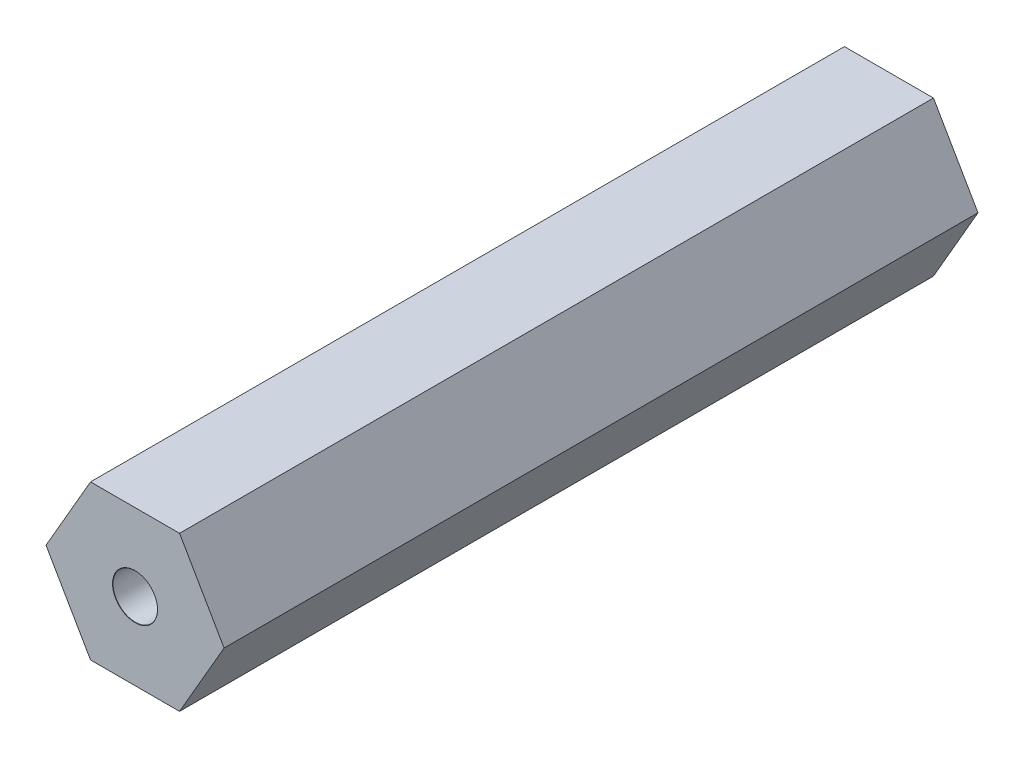
ISO-10303-21;
HEADER;
FILE_DESCRIPTION(('STEP AP214'),'2;1');
FILE_NAME('part.step','',(''),(''),'','','');
FILE_SCHEMA(('AUTOMOTIVE_DESIGN { 1 0 10303 214 1 1 1 1 }'));
ENDSEC;
DATA;
#1=APPLICATION_CONTEXT('core data for automotive mechanical design processes');
#2=APPLICATION_PROTOCOL_DEFINITION('international standard','automotive_design',2000,#1);
#3=PRODUCT_CONTEXT('',#1,'mechanical');
#4=PRODUCT('Part','Part','',(#3));
#5=PRODUCT_RELATED_PRODUCT_CATEGORY('part','',(#4));
#6=PRODUCT_DEFINITION_FORMATION('','',#4);
#7=PRODUCT_DEFINITION_CONTEXT('part definition',#1,'design');
#8=PRODUCT_DEFINITION('design','',#6,#7);
#9=PRODUCT_DEFINITION_SHAPE('','',#8);
#10=(LENGTH_UNIT() NAMED_UNIT(*) SI_UNIT(.MILLI.,.METRE.));
#11=(NAMED_UNIT(*) PLANE_ANGLE_UNIT() SI_UNIT($,.RADIAN.));
#12=(NAMED_UNIT(*) SI_UNIT($,.STERADIAN.) SOLID_ANGLE_UNIT());
#13=UNCERTAINTY_MEASURE_WITH_UNIT(LENGTH_MEASURE(1.E-05),#10,'distance_accuracy_value','');
#14=(GEOMETRIC_REPRESENTATION_CONTEXT(3) GLOBAL_UNCERTAINTY_ASSIGNED_CONTEXT((#13)) GLOBAL_UNIT_ASSIGNED_CONTEXT((#10,
#11,#12)) REPRESENTATION_CONTEXT('',''));
#15=CARTESIAN_POINT('',(0.,0.,0.));
#16=DIRECTION('',(0.,0.,1.));
#17=DIRECTION('',(1.,0.,0.));
#18=AXIS2_PLACEMENT_3D('',#15,#16,#17);
#19=CARTESIAN_POINT('',(0.,0.,-38.1));
#20=DIRECTION('',(0.,0.,1.));
#21=DIRECTION('',(1.,0.,0.));
#22=AXIS2_PLACEMENT_3D('',#19,#20,#21);
#23=PLANE('',#22);
#24=DIRECTION('',(0.5,-0.866025403784439,0.));
#25=VECTOR('',#24,1.);
#26=CARTESIAN_POINT('',(-9.,0.,-38.1));
#27=LINE('',#26,#25);
#28=CARTESIAN_POINT('',(-9.,0.,-38.1));
#29=VERTEX_POINT('',#28);
#30=CARTESIAN_POINT('',(-4.5,-7.79422863405994,-38.1));
#31=VERTEX_POINT('',#30);
#32=EDGE_CURVE('E295',#29,#31,#27,.T.);
#33=ORIENTED_EDGE('',*,*,#32,.F.);
#34=DIRECTION('',(-0.5,-0.866025403784439,0.));
#35=VECTOR('',#34,1.);
#36=CARTESIAN_POINT('',(-4.5,7.79422863405994,-38.1));
#37=LINE('',#36,#35);
#38=CARTESIAN_POINT('',(-4.5,7.79422863405994,-38.1));
#39=VERTEX_POINT('',#38);
#40=EDGE_CURVE('E316',#39,#29,#37,.T.);
#41=ORIENTED_EDGE('',*,*,#40,.F.);
#42=DIRECTION('',(-1.,0.,0.));
#43=VECTOR('',#42,1.);
#44=CARTESIAN_POINT('',(4.5,7.79422863405995,-38.1));
#45=LINE('',#44,#43);
#46=CARTESIAN_POINT('',(4.5,7.79422863405995,-38.1));
#47=VERTEX_POINT('',#46);
#48=EDGE_CURVE('E344',#47,#39,#45,.T.);
#49=ORIENTED_EDGE('',*,*,#48,.F.);
#50=DIRECTION('',(-0.5,0.866025403784439,0.));
#51=VECTOR('',#50,1.);
#52=CARTESIAN_POINT('',(9.,0.,-38.1));
#53=LINE('',#52,#51);
#54=CARTESIAN_POINT('',(9.,0.,-38.1));
#55=VERTEX_POINT('',#54);
#56=EDGE_CURVE('E341',#55,#47,#53,.T.);
#57=ORIENTED_EDGE('',*,*,#56,.F.);
#58=DIRECTION('',(0.5,0.866025403784439,0.));
#59=VECTOR('',#58,1.);
#60=CARTESIAN_POINT('',(4.5,-7.79422863405994,-38.1));
#61=LINE('',#60,#59);
#62=CARTESIAN_POINT('',(4.5,-7.79422863405994,-38.1));
#63=VERTEX_POINT('',#62);
#64=EDGE_CURVE('E338',#63,#55,#61,.T.);
#65=ORIENTED_EDGE('',*,*,#64,.F.);
#66=DIRECTION('',(1.,0.,0.));
#67=VECTOR('',#66,1.);
#68=CARTESIAN_POINT('',(-4.5,-7.79422863405994,-38.1));
#69=LINE('',#68,#67);
#70=EDGE_CURVE('E335',#31,#63,#69,.T.);
#71=ORIENTED_EDGE('',*,*,#70,.F.);
#72=EDGE_LOOP('',(#33,#41,#49,#57,#65,#71));
#73=FACE_BOUND('',#72,.T.);
#74=CARTESIAN_POINT('',(0.,0.,-38.1));
#75=DIRECTION('',(0.,0.,-1.));
#76=DIRECTION('',(-1.,0.,0.));
#77=AXIS2_PLACEMENT_3D('',#74,#75,#76);
#78=CIRCLE('',#77,2.275);
#79=CARTESIAN_POINT('',(-2.275,0.,-38.1));
#80=VERTEX_POINT('',#79);
#81=EDGE_CURVE('E738',#80,#80,#78,.T.);
#82=ORIENTED_EDGE('',*,*,#81,.F.);
#83=EDGE_LOOP('',(#82));
#84=FACE_BOUND('',#83,.T.);
#85=ADVANCED_FACE('F40',(#73,#84),#23,.F.);
#86=CARTESIAN_POINT('',(-9.,0.,38.1));
#87=DIRECTION('',(0.866025403784439,0.5,0.));
#88=DIRECTION('',(-0.5,0.866025403784439,0.));
#89=AXIS2_PLACEMENT_3D('',#86,#87,#88);
#90=PLANE('',#89);
#91=DIRECTION('',(0.5,-0.866025403784439,0.));
#92=VECTOR('',#91,1.);
#93=CARTESIAN_POINT('',(-6.75,-3.89711431702997,-23.6));
#94=LINE('',#93,#92);
#95=CARTESIAN_POINT('',(-9.,0.,-23.6));
#96=VERTEX_POINT('',#95);
#97=CARTESIAN_POINT('',(-6.8349364905389,-3.75,-23.6));
#98=VERTEX_POINT('',#97);
#99=EDGE_CURVE('E186',#96,#98,#94,.T.);
#100=ORIENTED_EDGE('',*,*,#99,.T.);
#101=DIRECTION('',(0.,0.,-1.));
#102=VECTOR('',#101,1.);
#103=CARTESIAN_POINT('',(-6.8349364905389,-3.75,-23.6));
#104=LINE('',#103,#102);
#105=CARTESIAN_POINT('',(-6.8349364905389,-3.75,-28.1));
#106=VERTEX_POINT('',#105);
#107=EDGE_CURVE('E170',#98,#106,#104,.T.);
#108=ORIENTED_EDGE('',*,*,#107,.T.);
#109=DIRECTION('',(0.5,-0.866025403784439,0.));
#110=VECTOR('',#109,1.);
#111=CARTESIAN_POINT('',(-6.75,-3.89711431702997,-28.1));
#112=LINE('',#111,#110);
#113=CARTESIAN_POINT('',(-9.,0.,-28.1));
#114=VERTEX_POINT('',#113);
#115=EDGE_CURVE('E216',#114,#106,#112,.T.);
#116=ORIENTED_EDGE('',*,*,#115,.F.);
#117=DIRECTION('',(0.,0.,-1.));
#118=VECTOR('',#117,1.);
#119=CARTESIAN_POINT('',(-9.,0.,38.1));
#120=LINE('',#119,#118);
#121=EDGE_CURVE('E331',#114,#29,#120,.T.);
#122=ORIENTED_EDGE('',*,*,#121,.T.);
#123=ORIENTED_EDGE('',*,*,#32,.T.);
#124=DIRECTION('',(0.,0.,-1.));
#125=VECTOR('',#124,1.);
#126=CARTESIAN_POINT('',(-4.5,-7.79422863405994,38.1));
#127=LINE('',#126,#125);
#128=CARTESIAN_POINT('',(-4.5,-7.79422863405994,38.1));
#129=VERTEX_POINT('',#128);
#130=EDGE_CURVE('E11',#129,#31,#127,.T.);
#131=ORIENTED_EDGE('',*,*,#130,.F.);
#132=DIRECTION('',(0.5,-0.866025403784439,0.));
#133=VECTOR('',#132,1.);
#134=CARTESIAN_POINT('',(-9.,0.,38.1));
#135=LINE('',#134,#133);
#136=CARTESIAN_POINT('',(-9.,0.,38.1));
#137=VERTEX_POINT('',#136);
#138=EDGE_CURVE('E311',#137,#129,#135,.T.);
#139=ORIENTED_EDGE('',*,*,#138,.F.);
#140=CARTESIAN_POINT('',(-9.,0.,28.1));
#141=VERTEX_POINT('',#140);
#142=EDGE_CURVE('E350',#137,#141,#120,.T.);
#143=ORIENTED_EDGE('',*,*,#142,.T.);
#144=DIRECTION('',(0.5,-0.866025403784439,0.));
#145=VECTOR('',#144,1.);
#146=CARTESIAN_POINT('',(-6.75,-3.89711431702997,28.1));
#147=LINE('',#146,#145);
#148=CARTESIAN_POINT('',(-6.8349364905389,-3.75,28.1));
#149=VERTEX_POINT('',#148);
#150=EDGE_CURVE('E64',#141,#149,#147,.T.);
#151=ORIENTED_EDGE('',*,*,#150,.T.);
#152=DIRECTION('',(0.,0.,1.));
#153=VECTOR('',#152,1.);
#154=CARTESIAN_POINT('',(-6.8349364905389,-3.75,23.6));
#155=LINE('',#154,#153);
#156=CARTESIAN_POINT('',(-6.8349364905389,-3.75,23.6));
#157=VERTEX_POINT('',#156);
#158=EDGE_CURVE('E292',#157,#149,#155,.T.);
#159=ORIENTED_EDGE('',*,*,#158,.F.);
#160=DIRECTION('',(0.5,-0.866025403784439,0.));
#161=VECTOR('',#160,1.);
#162=CARTESIAN_POINT('',(-6.75,-3.89711431702997,23.6));
#163=LINE('',#162,#161);
#164=CARTESIAN_POINT('',(-9.,0.,23.6));
#165=VERTEX_POINT('',#164);
#166=EDGE_CURVE('E271',#165,#157,#163,.T.);
#167=ORIENTED_EDGE('',*,*,#166,.F.);
#168=EDGE_CURVE('E196',#165,#96,#120,.T.);
#169=ORIENTED_EDGE('',*,*,#168,.T.);
#170=EDGE_LOOP('',(#100,#108,#116,#122,#123,#131,#139,#143,#151,#159,#167,#169));
#171=FACE_BOUND('',#170,.T.);
#172=ADVANCED_FACE('F42',(#171),#90,.F.);
#173=CARTESIAN_POINT('',(-4.5,7.79422863405994,38.1));
#174=DIRECTION('',(0.866025403784439,-0.5,0.));
#175=DIRECTION('',(0.5,0.866025403784439,0.));
#176=AXIS2_PLACEMENT_3D('',#173,#174,#175);
#177=PLANE('',#176);
#178=DIRECTION('',(-0.5,-0.866025403784439,0.));
#179=VECTOR('',#178,1.);
#180=CARTESIAN_POINT('',(-6.75,3.89711431702997,-23.6));
#181=LINE('',#180,#179);
#182=CARTESIAN_POINT('',(-6.8349364905389,3.75,-23.6));
#183=VERTEX_POINT('',#182);
#184=EDGE_CURVE('E198',#183,#96,#181,.T.);
#185=ORIENTED_EDGE('',*,*,#184,.T.);
#186=ORIENTED_EDGE('',*,*,#168,.F.);
#187=DIRECTION('',(-0.5,-0.866025403784439,0.));
#188=VECTOR('',#187,1.);
#189=CARTESIAN_POINT('',(-6.75,3.89711431702997,23.6));
#190=LINE('',#189,#188);
#191=CARTESIAN_POINT('',(-6.8349364905389,3.75,23.6));
#192=VERTEX_POINT('',#191);
#193=EDGE_CURVE('E268',#192,#165,#190,.T.);
#194=ORIENTED_EDGE('',*,*,#193,.F.);
#195=DIRECTION('',(0.,0.,1.));
#196=VECTOR('',#195,1.);
#197=CARTESIAN_POINT('',(-6.8349364905389,3.75,23.6));
#198=LINE('',#197,#196);
#199=CARTESIAN_POINT('',(-6.8349364905389,3.75,28.1));
#200=VERTEX_POINT('',#199);
#201=EDGE_CURVE('E296',#192,#200,#198,.T.);
#202=ORIENTED_EDGE('',*,*,#201,.T.);
#203=DIRECTION('',(-0.5,-0.866025403784439,0.));
#204=VECTOR('',#203,1.);
#205=CARTESIAN_POINT('',(-6.75,3.89711431702997,28.1));
#206=LINE('',#205,#204);
#207=EDGE_CURVE('E287',#200,#141,#206,.T.);
#208=ORIENTED_EDGE('',*,*,#207,.T.);
#209=ORIENTED_EDGE('',*,*,#142,.F.);
#210=DIRECTION('',(-0.5,-0.866025403784439,0.));
#211=VECTOR('',#210,1.);
#212=CARTESIAN_POINT('',(-4.5,7.79422863405994,38.1));
#213=LINE('',#212,#211);
#214=CARTESIAN_POINT('',(-4.5,7.79422863405994,38.1));
#215=VERTEX_POINT('',#214);
#216=EDGE_CURVE('E328',#215,#137,#213,.T.);
#217=ORIENTED_EDGE('',*,*,#216,.F.);
#218=DIRECTION('',(0.,0.,-1.));
#219=VECTOR('',#218,1.);
#220=CARTESIAN_POINT('',(-4.5,7.79422863405994,38.1));
#221=LINE('',#220,#219);
#222=EDGE_CURVE('E354',#215,#39,#221,.T.);
#223=ORIENTED_EDGE('',*,*,#222,.T.);
#224=ORIENTED_EDGE('',*,*,#40,.T.);
#225=ORIENTED_EDGE('',*,*,#121,.F.);
#226=DIRECTION('',(-0.5,-0.866025403784439,0.));
#227=VECTOR('',#226,1.);
#228=CARTESIAN_POINT('',(-6.75,3.89711431702997,-28.1));
#229=LINE('',#228,#227);
#230=CARTESIAN_POINT('',(-6.8349364905389,3.75,-28.1));
#231=VERTEX_POINT('',#230);
#232=EDGE_CURVE('E220',#231,#114,#229,.T.);
#233=ORIENTED_EDGE('',*,*,#232,.F.);
#234=DIRECTION('',(0.,0.,-1.));
#235=VECTOR('',#234,1.);
#236=CARTESIAN_POINT('',(-6.8349364905389,3.75,-23.6));
#237=LINE('',#236,#235);
#238=EDGE_CURVE('E181',#183,#231,#237,.T.);
#239=ORIENTED_EDGE('',*,*,#238,.F.);
#240=EDGE_LOOP('',(#185,#186,#194,#202,#208,#209,#217,#223,#224,#225,#233,#239));
#241=FACE_BOUND('',#240,.T.);
#242=ADVANCED_FACE('F398',(#241),#177,.F.);
#243=CARTESIAN_POINT('',(-4.5,-7.79422863405994,38.1));
#244=DIRECTION('',(0.,1.,0.));
#245=DIRECTION('',(0.,0.,1.));
#246=AXIS2_PLACEMENT_3D('',#243,#244,#245);
#247=PLANE('',#246);
#248=ORIENTED_EDGE('',*,*,#70,.T.);
#249=DIRECTION('',(0.,0.,-1.));
#250=VECTOR('',#249,1.);
#251=CARTESIAN_POINT('',(4.5,-7.79422863405994,38.1));
#252=LINE('',#251,#250);
#253=CARTESIAN_POINT('',(4.5,-7.79422863405994,38.1));
#254=VERTEX_POINT('',#253);
#255=EDGE_CURVE('E49',#254,#63,#252,.T.);
#256=ORIENTED_EDGE('',*,*,#255,.F.);
#257=DIRECTION('',(1.,0.,0.));
#258=VECTOR('',#257,1.);
#259=CARTESIAN_POINT('',(-4.5,-7.79422863405994,38.1));
#260=LINE('',#259,#258);
#261=EDGE_CURVE('E315',#129,#254,#260,.T.);
#262=ORIENTED_EDGE('',*,*,#261,.F.);
#263=ORIENTED_EDGE('',*,*,#130,.T.);
#264=EDGE_LOOP('',(#248,#256,#262,#263));
#265=FACE_BOUND('',#264,.T.);
#266=ADVANCED_FACE('F395',(#265),#247,.F.);
#267=CARTESIAN_POINT('',(4.5,-7.79422863405994,38.1));
#268=DIRECTION('',(-0.866025403784439,0.5,0.));
#269=DIRECTION('',(-0.5,-0.866025403784439,0.));
#270=AXIS2_PLACEMENT_3D('',#267,#268,#269);
#271=PLANE('',#270);
#272=ORIENTED_EDGE('',*,*,#64,.T.);
#273=DIRECTION('',(0.,0.,-1.));
#274=VECTOR('',#273,1.);
#275=CARTESIAN_POINT('',(9.,0.,38.1));
#276=LINE('',#275,#274);
#277=CARTESIAN_POINT('',(9.,0.,38.1));
#278=VERTEX_POINT('',#277);
#279=EDGE_CURVE('E362',#278,#55,#276,.T.);
#280=ORIENTED_EDGE('',*,*,#279,.F.);
#281=DIRECTION('',(0.5,0.866025403784439,0.));
#282=VECTOR('',#281,1.);
#283=CARTESIAN_POINT('',(4.5,-7.79422863405994,38.1));
#284=LINE('',#283,#282);
#285=EDGE_CURVE('E319',#254,#278,#284,.T.);
#286=ORIENTED_EDGE('',*,*,#285,.F.);
#287=ORIENTED_EDGE('',*,*,#255,.T.);
#288=EDGE_LOOP('',(#272,#280,#286,#287));
#289=FACE_BOUND('',#288,.T.);
#290=ADVANCED_FACE('F372',(#289),#271,.F.);
#291=CARTESIAN_POINT('',(9.,0.,38.1));
#292=DIRECTION('',(-0.866025403784439,-0.5,0.));
#293=DIRECTION('',(0.5,-0.866025403784439,0.));
#294=AXIS2_PLACEMENT_3D('',#291,#292,#293);
#295=PLANE('',#294);
#296=ORIENTED_EDGE('',*,*,#56,.T.);
#297=DIRECTION('',(0.,0.,-1.));
#298=VECTOR('',#297,1.);
#299=CARTESIAN_POINT('',(4.5,7.79422863405995,38.1));
#300=LINE('',#299,#298);
#301=CARTESIAN_POINT('',(4.5,7.79422863405995,38.1));
#302=VERTEX_POINT('',#301);
#303=EDGE_CURVE('E358',#302,#47,#300,.T.);
#304=ORIENTED_EDGE('',*,*,#303,.F.);
#305=DIRECTION('',(-0.5,0.866025403784439,0.));
#306=VECTOR('',#305,1.);
#307=CARTESIAN_POINT('',(9.,0.,38.1));
#308=LINE('',#307,#306);
#309=EDGE_CURVE('E322',#278,#302,#308,.T.);
#310=ORIENTED_EDGE('',*,*,#309,.F.);
#311=ORIENTED_EDGE('',*,*,#279,.T.);
#312=EDGE_LOOP('',(#296,#304,#310,#311));
#313=FACE_BOUND('',#312,.T.);
#314=ADVANCED_FACE('F383',(#313),#295,.F.);
#315=CARTESIAN_POINT('',(4.5,7.79422863405995,38.1));
#316=DIRECTION('',(0.,-1.,0.));
#317=DIRECTION('',(1.,0.,0.));
#318=AXIS2_PLACEMENT_3D('',#315,#316,#317);
#319=PLANE('',#318);
#320=ORIENTED_EDGE('',*,*,#48,.T.);
#321=ORIENTED_EDGE('',*,*,#222,.F.);
#322=DIRECTION('',(-1.,0.,0.));
#323=VECTOR('',#322,1.);
#324=CARTESIAN_POINT('',(4.5,7.79422863405995,38.1));
#325=LINE('',#324,#323);
#326=EDGE_CURVE('E325',#302,#215,#325,.T.);
#327=ORIENTED_EDGE('',*,*,#326,.F.);
#328=ORIENTED_EDGE('',*,*,#303,.T.);
#329=EDGE_LOOP('',(#320,#321,#327,#328));
#330=FACE_BOUND('',#329,.T.);
#331=ADVANCED_FACE('F387',(#330),#319,.F.);
#332=CARTESIAN_POINT('',(0.,0.,38.1));
#333=DIRECTION('',(0.,0.,1.));
#334=DIRECTION('',(1.,0.,0.));
#335=AXIS2_PLACEMENT_3D('',#332,#333,#334);
#336=PLANE('',#335);
#337=CARTESIAN_POINT('',(0.,0.,38.1));
#338=DIRECTION('',(0.,0.,1.));
#339=DIRECTION('',(1.,0.,0.));
#340=AXIS2_PLACEMENT_3D('',#337,#338,#339);
#341=CIRCLE('',#340,2.275);
#342=CARTESIAN_POINT('',(2.275,0.,38.1));
#343=VERTEX_POINT('',#342);
#344=EDGE_CURVE('E235',#343,#343,#341,.T.);
#345=ORIENTED_EDGE('',*,*,#344,.F.);
#346=EDGE_LOOP('',(#345));
#347=FACE_BOUND('',#346,.T.);
#348=ORIENTED_EDGE('',*,*,#138,.T.);
#349=ORIENTED_EDGE('',*,*,#261,.T.);
#350=ORIENTED_EDGE('',*,*,#285,.T.);
#351=ORIENTED_EDGE('',*,*,#309,.T.);
#352=ORIENTED_EDGE('',*,*,#326,.T.);
#353=ORIENTED_EDGE('',*,*,#216,.T.);
#354=EDGE_LOOP('',(#348,#349,#350,#351,#352,#353));
#355=FACE_BOUND('',#354,.T.);
#356=ADVANCED_FACE('F391',(#347,#355),#336,.T.);
#357=CARTESIAN_POINT('',(0.,-3.75,23.6));
#358=DIRECTION('',(0.,1.,0.));
#359=DIRECTION('',(0.,0.,1.));
#360=AXIS2_PLACEMENT_3D('',#357,#358,#359);
#361=PLANE('',#360);
#362=DIRECTION('',(-1.,0.,0.));
#363=VECTOR('',#362,1.);
#364=CARTESIAN_POINT('',(0.,-3.75,28.1));
#365=LINE('',#364,#363);
#366=CARTESIAN_POINT('',(2.1650635094611,-3.75,28.1));
#367=VERTEX_POINT('',#366);
#368=EDGE_CURVE('E255',#367,#149,#365,.T.);
#369=ORIENTED_EDGE('',*,*,#368,.F.);
#370=DIRECTION('',(0.,0.,1.));
#371=VECTOR('',#370,1.);
#372=CARTESIAN_POINT('',(2.1650635094611,-3.75,23.6));
#373=LINE('',#372,#371);
#374=CARTESIAN_POINT('',(2.1650635094611,-3.75,23.6));
#375=VERTEX_POINT('',#374);
#376=EDGE_CURVE('E275',#375,#367,#373,.T.);
#377=ORIENTED_EDGE('',*,*,#376,.F.);
#378=DIRECTION('',(-1.,0.,0.));
#379=VECTOR('',#378,1.);
#380=CARTESIAN_POINT('',(0.,-3.75,23.6));
#381=LINE('',#380,#379);
#382=EDGE_CURVE('E256',#375,#157,#381,.T.);
#383=ORIENTED_EDGE('',*,*,#382,.T.);
#384=ORIENTED_EDGE('',*,*,#158,.T.);
#385=EDGE_LOOP('',(#369,#377,#383,#384));
#386=FACE_BOUND('',#385,.T.);
#387=ADVANCED_FACE('F403',(#386),#361,.T.);
#388=CARTESIAN_POINT('',(0.,3.75,23.6));
#389=DIRECTION('',(0.,-1.,0.));
#390=DIRECTION('',(1.,0.,0.));
#391=AXIS2_PLACEMENT_3D('',#388,#389,#390);
#392=PLANE('',#391);
#393=DIRECTION('',(1.,0.,0.));
#394=VECTOR('',#393,1.);
#395=CARTESIAN_POINT('',(0.,3.75,28.1));
#396=LINE('',#395,#394);
#397=CARTESIAN_POINT('',(2.1650635094611,3.75,28.1));
#398=VERTEX_POINT('',#397);
#399=EDGE_CURVE('E284',#200,#398,#396,.T.);
#400=ORIENTED_EDGE('',*,*,#399,.F.);
#401=ORIENTED_EDGE('',*,*,#201,.F.);
#402=DIRECTION('',(1.,0.,0.));
#403=VECTOR('',#402,1.);
#404=CARTESIAN_POINT('',(0.,3.75,23.6));
#405=LINE('',#404,#403);
#406=CARTESIAN_POINT('',(2.1650635094611,3.75,23.6));
#407=VERTEX_POINT('',#406);
#408=EDGE_CURVE('E265',#192,#407,#405,.T.);
#409=ORIENTED_EDGE('',*,*,#408,.T.);
#410=DIRECTION('',(0.,0.,1.));
#411=VECTOR('',#410,1.);
#412=CARTESIAN_POINT('',(2.1650635094611,3.75,23.6));
#413=LINE('',#412,#411);
#414=EDGE_CURVE('E300',#407,#398,#413,.T.);
#415=ORIENTED_EDGE('',*,*,#414,.T.);
#416=EDGE_LOOP('',(#400,#401,#409,#415));
#417=FACE_BOUND('',#416,.T.);
#418=ADVANCED_FACE('F538',(#417),#392,.T.);
#419=CARTESIAN_POINT('',(3.24759526419165,1.875,23.6));
#420=DIRECTION('',(-0.866025403784439,-0.5,0.));
#421=DIRECTION('',(0.5,-0.866025403784439,0.));
#422=AXIS2_PLACEMENT_3D('',#419,#420,#421);
#423=PLANE('',#422);
#424=DIRECTION('',(0.5,-0.866025403784439,0.));
#425=VECTOR('',#424,1.);
#426=CARTESIAN_POINT('',(3.24759526419165,1.875,28.1));
#427=LINE('',#426,#425);
#428=CARTESIAN_POINT('',(4.33012701892219,0.,28.1));
#429=VERTEX_POINT('',#428);
#430=EDGE_CURVE('E281',#398,#429,#427,.T.);
#431=ORIENTED_EDGE('',*,*,#430,.F.);
#432=ORIENTED_EDGE('',*,*,#414,.F.);
#433=DIRECTION('',(0.5,-0.866025403784439,0.));
#434=VECTOR('',#433,1.);
#435=CARTESIAN_POINT('',(3.24759526419165,1.875,23.6));
#436=LINE('',#435,#434);
#437=CARTESIAN_POINT('',(4.33012701892219,0.,23.6));
#438=VERTEX_POINT('',#437);
#439=EDGE_CURVE('E262',#407,#438,#436,.T.);
#440=ORIENTED_EDGE('',*,*,#439,.T.);
#441=DIRECTION('',(0.,0.,1.));
#442=VECTOR('',#441,1.);
#443=CARTESIAN_POINT('',(4.33012701892219,0.,23.6));
#444=LINE('',#443,#442);
#445=EDGE_CURVE('E304',#438,#429,#444,.T.);
#446=ORIENTED_EDGE('',*,*,#445,.T.);
#447=EDGE_LOOP('',(#431,#432,#440,#446));
#448=FACE_BOUND('',#447,.T.);
#449=ADVANCED_FACE('F544',(#448),#423,.T.);
#450=CARTESIAN_POINT('',(3.24759526419165,-1.875,23.6));
#451=DIRECTION('',(-0.866025403784439,0.5,0.));
#452=DIRECTION('',(-0.5,-0.866025403784439,0.));
#453=AXIS2_PLACEMENT_3D('',#450,#451,#452);
#454=PLANE('',#453);
#455=DIRECTION('',(-0.5,-0.866025403784439,0.));
#456=VECTOR('',#455,1.);
#457=CARTESIAN_POINT('',(3.24759526419165,-1.875,28.1));
#458=LINE('',#457,#456);
#459=EDGE_CURVE('E278',#429,#367,#458,.T.);
#460=ORIENTED_EDGE('',*,*,#459,.F.);
#461=ORIENTED_EDGE('',*,*,#445,.F.);
#462=DIRECTION('',(-0.5,-0.866025403784439,0.));
#463=VECTOR('',#462,1.);
#464=CARTESIAN_POINT('',(3.24759526419165,-1.875,23.6));
#465=LINE('',#464,#463);
#466=EDGE_CURVE('E259',#438,#375,#465,.T.);
#467=ORIENTED_EDGE('',*,*,#466,.T.);
#468=ORIENTED_EDGE('',*,*,#376,.T.);
#469=EDGE_LOOP('',(#460,#461,#467,#468));
#470=FACE_BOUND('',#469,.T.);
#471=ADVANCED_FACE('F411',(#470),#454,.T.);
#472=CARTESIAN_POINT('',(0.,0.,23.6));
#473=DIRECTION('',(0.,0.,1.));
#474=DIRECTION('',(1.,0.,0.));
#475=AXIS2_PLACEMENT_3D('',#472,#473,#474);
#476=PLANE('',#475);
#477=ORIENTED_EDGE('',*,*,#382,.F.);
#478=ORIENTED_EDGE('',*,*,#466,.F.);
#479=ORIENTED_EDGE('',*,*,#439,.F.);
#480=ORIENTED_EDGE('',*,*,#408,.F.);
#481=ORIENTED_EDGE('',*,*,#193,.T.);
#482=ORIENTED_EDGE('',*,*,#166,.T.);
#483=EDGE_LOOP('',(#477,#478,#479,#480,#481,#482));
#484=FACE_BOUND('',#483,.T.);
#485=ADVANCED_FACE('F414',(#484),#476,.T.);
#486=CARTESIAN_POINT('',(0.,0.,28.1));
#487=DIRECTION('',(0.,0.,1.));
#488=DIRECTION('',(1.,0.,0.));
#489=AXIS2_PLACEMENT_3D('',#486,#487,#488);
#490=PLANE('',#489);
#491=CARTESIAN_POINT('',(0.,0.,28.1));
#492=DIRECTION('',(0.,0.,1.));
#493=DIRECTION('',(1.,0.,0.));
#494=AXIS2_PLACEMENT_3D('',#491,#492,#493);
#495=CIRCLE('',#494,2.25);
#496=CARTESIAN_POINT('',(2.25,0.,28.1));
#497=VERTEX_POINT('',#496);
#498=EDGE_CURVE('E251',#497,#497,#495,.T.);
#499=ORIENTED_EDGE('',*,*,#498,.T.);
#500=EDGE_LOOP('',(#499));
#501=FACE_BOUND('',#500,.T.);
#502=ORIENTED_EDGE('',*,*,#368,.T.);
#503=ORIENTED_EDGE('',*,*,#150,.F.);
#504=ORIENTED_EDGE('',*,*,#207,.F.);
#505=ORIENTED_EDGE('',*,*,#399,.T.);
#506=ORIENTED_EDGE('',*,*,#430,.T.);
#507=ORIENTED_EDGE('',*,*,#459,.T.);
#508=EDGE_LOOP('',(#502,#503,#504,#505,#506,#507));
#509=FACE_BOUND('',#508,.T.);
#510=ADVANCED_FACE('F406',(#501,#509),#490,.F.);
#511=CARTESIAN_POINT('',(0.,0.,38.1));
#512=DIRECTION('',(0.,0.,1.));
#513=DIRECTION('',(1.,0.,0.));
#514=AXIS2_PLACEMENT_3D('',#511,#512,#513);
#515=CYLINDRICAL_SURFACE('',#514,2.25);
#516=ORIENTED_EDGE('',*,*,#498,.F.);
#517=EDGE_LOOP('',(#516));
#518=FACE_BOUND('',#517,.T.);
#519=CARTESIAN_POINT('',(0.,0.,38.075));
#520=DIRECTION('',(0.,0.,1.));
#521=DIRECTION('',(1.,0.,0.));
#522=AXIS2_PLACEMENT_3D('',#519,#520,#521);
#523=CIRCLE('',#522,2.25);
#524=CARTESIAN_POINT('',(2.25,0.,38.075));
#525=VERTEX_POINT('',#524);
#526=EDGE_CURVE('E247',#525,#525,#523,.T.);
#527=ORIENTED_EDGE('',*,*,#526,.T.);
#528=EDGE_LOOP('',(#527));
#529=FACE_BOUND('',#528,.T.);
#530=ADVANCED_FACE('F569',(#518,#529),#515,.F.);
#531=CARTESIAN_POINT('',(0.,0.,38.1));
#532=DIRECTION('',(0.,0.,1.));
#533=DIRECTION('',(1.,0.,0.));
#534=AXIS2_PLACEMENT_3D('',#531,#532,#533);
#535=CONICAL_SURFACE('',#534,2.275,0.785398163397396);
#536=ORIENTED_EDGE('',*,*,#526,.F.);
#537=EDGE_LOOP('',(#536));
#538=FACE_BOUND('',#537,.T.);
#539=ORIENTED_EDGE('',*,*,#344,.T.);
#540=EDGE_LOOP('',(#539));
#541=FACE_BOUND('',#540,.T.);
#542=ADVANCED_FACE('F577',(#538,#541),#535,.F.);
#543=CARTESIAN_POINT('',(0.,-3.75,-23.6));
#544=DIRECTION('',(0.,-1.,0.));
#545=DIRECTION('',(0.,0.,-1.));
#546=AXIS2_PLACEMENT_3D('',#543,#544,#545);
#547=PLANE('',#546);
#548=DIRECTION('',(-1.,0.,0.));
#549=VECTOR('',#548,1.);
#550=CARTESIAN_POINT('',(0.,-3.75,-28.1));
#551=LINE('',#550,#549);
#552=CARTESIAN_POINT('',(2.1650635094611,-3.75,-28.1));
#553=VERTEX_POINT('',#552);
#554=EDGE_CURVE('E176',#553,#106,#551,.T.);
#555=ORIENTED_EDGE('',*,*,#554,.T.);
#556=ORIENTED_EDGE('',*,*,#107,.F.);
#557=DIRECTION('',(-1.,0.,0.));
#558=VECTOR('',#557,1.);
#559=CARTESIAN_POINT('',(0.,-3.75,-23.6));
#560=LINE('',#559,#558);
#561=CARTESIAN_POINT('',(2.1650635094611,-3.75,-23.6));
#562=VERTEX_POINT('',#561);
#563=EDGE_CURVE('E173',#562,#98,#560,.T.);
#564=ORIENTED_EDGE('',*,*,#563,.F.);
#565=DIRECTION('',(0.,0.,-1.));
#566=VECTOR('',#565,1.);
#567=CARTESIAN_POINT('',(2.1650635094611,-3.75,-23.6));
#568=LINE('',#567,#566);
#569=EDGE_CURVE('E232',#562,#553,#568,.T.);
#570=ORIENTED_EDGE('',*,*,#569,.T.);
#571=EDGE_LOOP('',(#555,#556,#564,#570));
#572=FACE_BOUND('',#571,.T.);
#573=ADVANCED_FACE('F172',(#572),#547,.F.);
#574=CARTESIAN_POINT('',(3.24759526419165,-1.875,-23.6));
#575=DIRECTION('',(0.866025403784439,-0.5,0.));
#576=DIRECTION('',(0.5,0.866025403784439,0.));
#577=AXIS2_PLACEMENT_3D('',#574,#575,#576);
#578=PLANE('',#577);
#579=DIRECTION('',(-0.5,-0.866025403784439,0.));
#580=VECTOR('',#579,1.);
#581=CARTESIAN_POINT('',(3.24759526419165,-1.875,-28.1));
#582=LINE('',#581,#580);
#583=CARTESIAN_POINT('',(4.33012701892219,0.,-28.1));
#584=VERTEX_POINT('',#583);
#585=EDGE_CURVE('E191',#584,#553,#582,.T.);
#586=ORIENTED_EDGE('',*,*,#585,.T.);
#587=ORIENTED_EDGE('',*,*,#569,.F.);
#588=DIRECTION('',(-0.5,-0.866025403784439,0.));
#589=VECTOR('',#588,1.);
#590=CARTESIAN_POINT('',(3.24759526419165,-1.875,-23.6));
#591=LINE('',#590,#589);
#592=CARTESIAN_POINT('',(4.33012701892219,0.,-23.6));
#593=VERTEX_POINT('',#592);
#594=EDGE_CURVE('E182',#593,#562,#591,.T.);
#595=ORIENTED_EDGE('',*,*,#594,.F.);
#596=DIRECTION('',(0.,0.,-1.));
#597=VECTOR('',#596,1.);
#598=CARTESIAN_POINT('',(4.33012701892219,0.,-23.6));
#599=LINE('',#598,#597);
#600=EDGE_CURVE('E236',#593,#584,#599,.T.);
#601=ORIENTED_EDGE('',*,*,#600,.T.);
#602=EDGE_LOOP('',(#586,#587,#595,#601));
#603=FACE_BOUND('',#602,.T.);
#604=ADVANCED_FACE('F475',(#603),#578,.F.);
#605=CARTESIAN_POINT('',(3.24759526419165,1.875,-23.6));
#606=DIRECTION('',(0.866025403784439,0.5,0.));
#607=DIRECTION('',(-0.5,0.866025403784439,0.));
#608=AXIS2_PLACEMENT_3D('',#605,#606,#607);
#609=PLANE('',#608);
#610=DIRECTION('',(0.5,-0.866025403784439,0.));
#611=VECTOR('',#610,1.);
#612=CARTESIAN_POINT('',(3.24759526419165,1.875,-28.1));
#613=LINE('',#612,#611);
#614=CARTESIAN_POINT('',(2.1650635094611,3.75,-28.1));
#615=VERTEX_POINT('',#614);
#616=EDGE_CURVE('E225',#615,#584,#613,.T.);
#617=ORIENTED_EDGE('',*,*,#616,.T.);
#618=ORIENTED_EDGE('',*,*,#600,.F.);
#619=DIRECTION('',(0.5,-0.866025403784439,0.));
#620=VECTOR('',#619,1.);
#621=CARTESIAN_POINT('',(3.24759526419165,1.875,-23.6));
#622=LINE('',#621,#620);
#623=CARTESIAN_POINT('',(2.1650635094611,3.75,-23.6));
#624=VERTEX_POINT('',#623);
#625=EDGE_CURVE('E209',#624,#593,#622,.T.);
#626=ORIENTED_EDGE('',*,*,#625,.F.);
#627=DIRECTION('',(0.,0.,-1.));
#628=VECTOR('',#627,1.);
#629=CARTESIAN_POINT('',(2.1650635094611,3.75,-23.6));
#630=LINE('',#629,#628);
#631=EDGE_CURVE('E239',#624,#615,#630,.T.);
#632=ORIENTED_EDGE('',*,*,#631,.T.);
#633=EDGE_LOOP('',(#617,#618,#626,#632));
#634=FACE_BOUND('',#633,.T.);
#635=ADVANCED_FACE('F473',(#634),#609,.F.);
#636=CARTESIAN_POINT('',(0.,3.75,-23.6));
#637=DIRECTION('',(0.,1.,0.));
#638=DIRECTION('',(-1.,0.,0.));
#639=AXIS2_PLACEMENT_3D('',#636,#637,#638);
#640=PLANE('',#639);
#641=DIRECTION('',(1.,0.,0.));
#642=VECTOR('',#641,1.);
#643=CARTESIAN_POINT('',(0.,3.75,-28.1));
#644=LINE('',#643,#642);
#645=EDGE_CURVE('E56',#231,#615,#644,.T.);
#646=ORIENTED_EDGE('',*,*,#645,.T.);
#647=ORIENTED_EDGE('',*,*,#631,.F.);
#648=DIRECTION('',(1.,0.,0.));
#649=VECTOR('',#648,1.);
#650=CARTESIAN_POINT('',(0.,3.75,-23.6));
#651=LINE('',#650,#649);
#652=EDGE_CURVE('E202',#183,#624,#651,.T.);
#653=ORIENTED_EDGE('',*,*,#652,.F.);
#654=ORIENTED_EDGE('',*,*,#238,.T.);
#655=EDGE_LOOP('',(#646,#647,#653,#654));
#656=FACE_BOUND('',#655,.T.);
#657=ADVANCED_FACE('F470',(#656),#640,.F.);
#658=CARTESIAN_POINT('',(0.,0.,-23.6));
#659=DIRECTION('',(0.,0.,-1.));
#660=DIRECTION('',(1.,0.,0.));
#661=AXIS2_PLACEMENT_3D('',#658,#659,#660);
#662=PLANE('',#661);
#663=ORIENTED_EDGE('',*,*,#563,.T.);
#664=ORIENTED_EDGE('',*,*,#99,.F.);
#665=ORIENTED_EDGE('',*,*,#184,.F.);
#666=ORIENTED_EDGE('',*,*,#652,.T.);
#667=ORIENTED_EDGE('',*,*,#625,.T.);
#668=ORIENTED_EDGE('',*,*,#594,.T.);
#669=EDGE_LOOP('',(#663,#664,#665,#666,#667,#668));
#670=FACE_BOUND('',#669,.T.);
#671=ADVANCED_FACE('F185',(#670),#662,.T.);
#672=CARTESIAN_POINT('',(0.,0.,-28.1));
#673=DIRECTION('',(0.,0.,-1.));
#674=DIRECTION('',(1.,0.,0.));
#675=AXIS2_PLACEMENT_3D('',#672,#673,#674);
#676=PLANE('',#675);
#677=CARTESIAN_POINT('',(0.,0.,-28.1));
#678=DIRECTION('',(0.,0.,-1.));
#679=DIRECTION('',(-1.,0.,0.));
#680=AXIS2_PLACEMENT_3D('',#677,#678,#679);
#681=CIRCLE('',#680,2.25);
#682=CARTESIAN_POINT('',(-2.25,0.,-28.1));
#683=VERTEX_POINT('',#682);
#684=EDGE_CURVE('E217',#683,#683,#681,.T.);
#685=ORIENTED_EDGE('',*,*,#684,.T.);
#686=EDGE_LOOP('',(#685));
#687=FACE_BOUND('',#686,.T.);
#688=ORIENTED_EDGE('',*,*,#554,.F.);
#689=ORIENTED_EDGE('',*,*,#585,.F.);
#690=ORIENTED_EDGE('',*,*,#616,.F.);
#691=ORIENTED_EDGE('',*,*,#645,.F.);
#692=ORIENTED_EDGE('',*,*,#232,.T.);
#693=ORIENTED_EDGE('',*,*,#115,.T.);
#694=EDGE_LOOP('',(#688,#689,#690,#691,#692,#693));
#695=FACE_BOUND('',#694,.T.);
#696=ADVANCED_FACE('F477',(#687,#695),#676,.F.);
#697=CARTESIAN_POINT('',(0.,0.,-38.1));
#698=DIRECTION('',(0.,0.,-1.));
#699=DIRECTION('',(-1.,0.,0.));
#700=AXIS2_PLACEMENT_3D('',#697,#698,#699);
#701=CYLINDRICAL_SURFACE('',#700,2.25);
#702=ORIENTED_EDGE('',*,*,#684,.F.);
#703=EDGE_LOOP('',(#702));
#704=FACE_BOUND('',#703,.T.);
#705=CARTESIAN_POINT('',(0.,0.,-38.075));
#706=DIRECTION('',(0.,0.,-1.));
#707=DIRECTION('',(-1.,0.,0.));
#708=AXIS2_PLACEMENT_3D('',#705,#706,#707);
#709=CIRCLE('',#708,2.25);
#710=CARTESIAN_POINT('',(-2.25,0.,-38.075));
#711=VERTEX_POINT('',#710);
#712=EDGE_CURVE('E735',#711,#711,#709,.T.);
#713=ORIENTED_EDGE('',*,*,#712,.T.);
#714=EDGE_LOOP('',(#713));
#715=FACE_BOUND('',#714,.T.);
#716=ADVANCED_FACE('F479',(#704,#715),#701,.F.);
#717=CARTESIAN_POINT('',(0.,0.,-38.1));
#718=DIRECTION('',(0.,0.,-1.));
#719=DIRECTION('',(-1.,0.,0.));
#720=AXIS2_PLACEMENT_3D('',#717,#718,#719);
#721=CONICAL_SURFACE('',#720,2.275,0.785398163397396);
#722=ORIENTED_EDGE('',*,*,#712,.F.);
#723=EDGE_LOOP('',(#722));
#724=FACE_BOUND('',#723,.T.);
#725=ORIENTED_EDGE('',*,*,#81,.T.);
#726=EDGE_LOOP('',(#725));
#727=FACE_BOUND('',#726,.T.);
#728=ADVANCED_FACE('F486',(#724,#727),#721,.F.);
#729=CLOSED_SHELL('',(#85,#172,#242,#266,#290,#314,#331,#356,#387,#418,#449,#471,#485,#510,#530,
#542,#573,#604,#635,#657,#671,#696,#716,#728));
#730=MANIFOLD_SOLID_BREP('B2',#729);
#731=ADVANCED_BREP_SHAPE_REPRESENTATION('',(#18,#730),#14);
#732=SHAPE_DEFINITION_REPRESENTATION(#9,#731);
ENDSEC;
END-ISO-10303-21;
